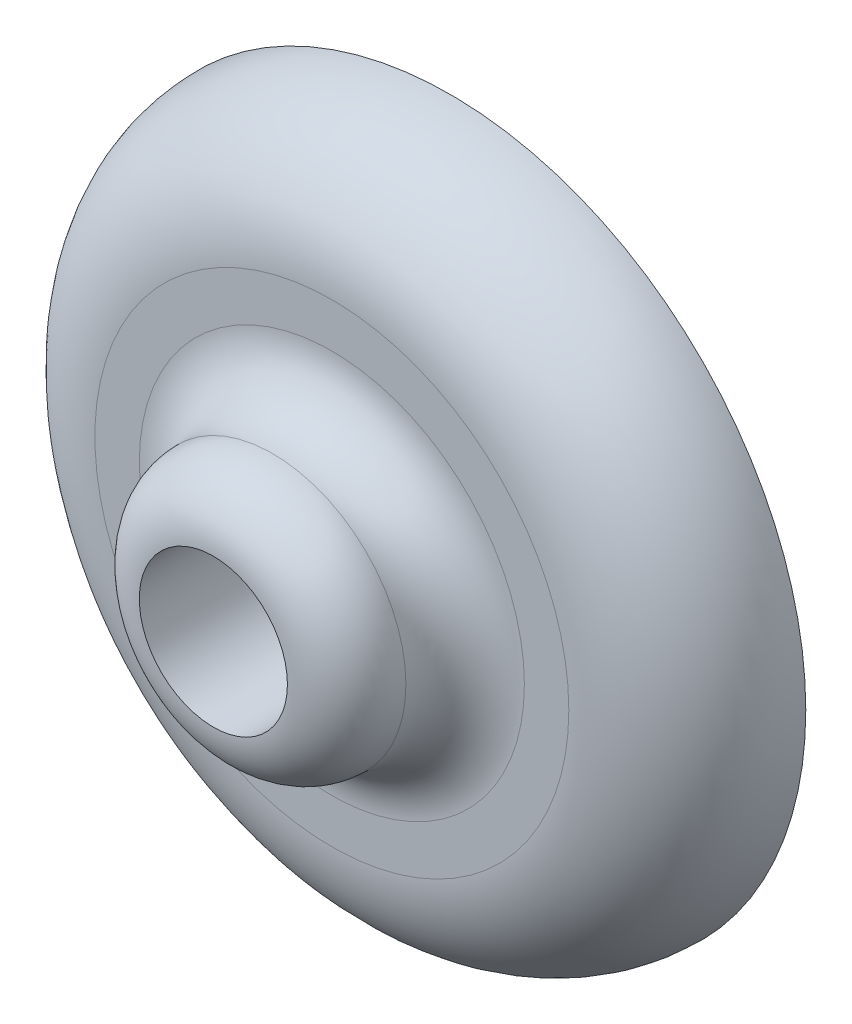
ISO-10303-21;
HEADER;
FILE_DESCRIPTION(('STEP AP214'),'2;1');
FILE_NAME('part.step','',(''),(''),'','','');
FILE_SCHEMA(('AUTOMOTIVE_DESIGN { 1 0 10303 214 1 1 1 1 }'));
ENDSEC;
DATA;
#1=APPLICATION_CONTEXT('core data for automotive mechanical design processes');
#2=APPLICATION_PROTOCOL_DEFINITION('international standard','automotive_design',2000,#1);
#3=PRODUCT_CONTEXT('',#1,'mechanical');
#4=PRODUCT('Part','Part','',(#3));
#5=PRODUCT_RELATED_PRODUCT_CATEGORY('part','',(#4));
#6=PRODUCT_DEFINITION_FORMATION('','',#4);
#7=PRODUCT_DEFINITION_CONTEXT('part definition',#1,'design');
#8=PRODUCT_DEFINITION('design','',#6,#7);
#9=PRODUCT_DEFINITION_SHAPE('','',#8);
#10=(LENGTH_UNIT() NAMED_UNIT(*) SI_UNIT(.MILLI.,.METRE.));
#11=(NAMED_UNIT(*) PLANE_ANGLE_UNIT() SI_UNIT($,.RADIAN.));
#12=(NAMED_UNIT(*) SI_UNIT($,.STERADIAN.) SOLID_ANGLE_UNIT());
#13=UNCERTAINTY_MEASURE_WITH_UNIT(LENGTH_MEASURE(1.E-05),#10,'distance_accuracy_value','');
#14=(GEOMETRIC_REPRESENTATION_CONTEXT(3) GLOBAL_UNCERTAINTY_ASSIGNED_CONTEXT((#13)) GLOBAL_UNIT_ASSIGNED_CONTEXT((#10,
#11,#12)) REPRESENTATION_CONTEXT('',''));
#15=CARTESIAN_POINT('',(0.,0.,0.));
#16=DIRECTION('',(0.,0.,1.));
#17=DIRECTION('',(1.,0.,0.));
#18=AXIS2_PLACEMENT_3D('',#15,#16,#17);
#19=CARTESIAN_POINT('',(0.,0.,2.));
#20=DIRECTION('',(0.,0.,1.));
#21=DIRECTION('',(1.,0.,0.));
#22=AXIS2_PLACEMENT_3D('',#19,#20,#21);
#23=PLANE('',#22);
#24=CARTESIAN_POINT('',(0.,0.,2.));
#25=DIRECTION('',(0.,0.,1.));
#26=DIRECTION('',(1.,0.,0.));
#27=AXIS2_PLACEMENT_3D('',#24,#25,#26);
#28=CIRCLE('',#27,4.);
#29=CARTESIAN_POINT('',(4.,0.,2.));
#30=VERTEX_POINT('',#29);
#31=EDGE_CURVE('E10',#30,#30,#28,.T.);
#32=ORIENTED_EDGE('',*,*,#31,.T.);
#33=EDGE_LOOP('',(#32));
#34=FACE_BOUND('',#33,.T.);
#35=CARTESIAN_POINT('',(0.,0.,2.));
#36=DIRECTION('',(0.,0.,1.));
#37=DIRECTION('',(1.,0.,0.));
#38=AXIS2_PLACEMENT_3D('',#35,#36,#37);
#39=CIRCLE('',#38,3.25);
#40=CARTESIAN_POINT('',(3.25,0.,2.));
#41=VERTEX_POINT('',#40);
#42=EDGE_CURVE('E39',#41,#41,#39,.F.);
#43=ORIENTED_EDGE('',*,*,#42,.T.);
#44=EDGE_LOOP('',(#43));
#45=FACE_BOUND('',#44,.T.);
#46=ADVANCED_FACE('F32',(#34,#45),#23,.T.);
#47=CARTESIAN_POINT('',(0.,0.,0.));
#48=DIRECTION('',(0.,0.,1.));
#49=DIRECTION('',(1.,0.,0.));
#50=AXIS2_PLACEMENT_3D('',#47,#48,#49);
#51=PLANE('',#50);
#52=CARTESIAN_POINT('',(0.,0.,0.));
#53=DIRECTION('',(0.,0.,1.));
#54=DIRECTION('',(1.,0.,0.));
#55=AXIS2_PLACEMENT_3D('',#52,#53,#54);
#56=CIRCLE('',#55,6.);
#57=CARTESIAN_POINT('',(6.,0.,0.));
#58=VERTEX_POINT('',#57);
#59=EDGE_CURVE('E43',#58,#58,#56,.T.);
#60=ORIENTED_EDGE('',*,*,#59,.F.);
#61=EDGE_LOOP('',(#60));
#62=FACE_BOUND('',#61,.T.);
#63=CARTESIAN_POINT('',(0.,0.,0.));
#64=DIRECTION('',(0.,0.,1.));
#65=DIRECTION('',(1.,0.,0.));
#66=AXIS2_PLACEMENT_3D('',#63,#64,#65);
#67=CIRCLE('',#66,1.25);
#68=CARTESIAN_POINT('',(1.25,0.,0.));
#69=VERTEX_POINT('',#68);
#70=EDGE_CURVE('E48',#69,#69,#67,.T.);
#71=ORIENTED_EDGE('',*,*,#70,.T.);
#72=EDGE_LOOP('',(#71));
#73=FACE_BOUND('',#72,.T.);
#74=ADVANCED_FACE('F63',(#62,#73),#51,.F.);
#75=CARTESIAN_POINT('',(0.,0.,2.));
#76=DIRECTION('',(0.,0.,-1.));
#77=DIRECTION('',(-1.,0.,0.));
#78=AXIS2_PLACEMENT_3D('',#75,#76,#77);
#79=CYLINDRICAL_SURFACE('',#78,1.25);
#80=ORIENTED_EDGE('',*,*,#70,.F.);
#81=EDGE_LOOP('',(#80));
#82=FACE_BOUND('',#81,.T.);
#83=CARTESIAN_POINT('',(0.,0.,4.));
#84=DIRECTION('',(0.,0.,1.));
#85=DIRECTION('',(1.,0.,0.));
#86=AXIS2_PLACEMENT_3D('',#83,#84,#85);
#87=CIRCLE('',#86,1.25);
#88=CARTESIAN_POINT('',(1.25,0.,4.));
#89=VERTEX_POINT('',#88);
#90=EDGE_CURVE('E53',#89,#89,#87,.T.);
#91=ORIENTED_EDGE('',*,*,#90,.T.);
#92=EDGE_LOOP('',(#91));
#93=FACE_BOUND('',#92,.T.);
#94=ADVANCED_FACE('F65',(#82,#93),#79,.F.);
#95=CARTESIAN_POINT('',(0.,0.,3.));
#96=DIRECTION('',(0.,0.,1.));
#97=DIRECTION('',(1.,0.,0.));
#98=AXIS2_PLACEMENT_3D('',#95,#96,#97);
#99=TOROIDAL_SURFACE('',#98,1.25,1.);
#100=ORIENTED_EDGE('',*,*,#90,.F.);
#101=EDGE_LOOP('',(#100));
#102=FACE_BOUND('',#101,.T.);
#103=CARTESIAN_POINT('',(0.,0.,3.));
#104=DIRECTION('',(0.,0.,1.));
#105=DIRECTION('',(1.,0.,0.));
#106=AXIS2_PLACEMENT_3D('',#103,#104,#105);
#107=CIRCLE('',#106,2.25);
#108=CARTESIAN_POINT('',(2.25,0.,3.));
#109=VERTEX_POINT('',#108);
#110=EDGE_CURVE('E51',#109,#109,#107,.F.);
#111=ORIENTED_EDGE('',*,*,#110,.F.);
#112=EDGE_LOOP('',(#111));
#113=FACE_BOUND('',#112,.T.);
#114=ADVANCED_FACE('F67',(#102,#113),#99,.T.);
#115=CARTESIAN_POINT('',(0.,0.,3.));
#116=DIRECTION('',(0.,0.,1.));
#117=DIRECTION('',(1.,0.,0.));
#118=AXIS2_PLACEMENT_3D('',#115,#116,#117);
#119=TOROIDAL_SURFACE('',#118,3.25,1.);
#120=ORIENTED_EDGE('',*,*,#42,.F.);
#121=EDGE_LOOP('',(#120));
#122=FACE_BOUND('',#121,.T.);
#123=ORIENTED_EDGE('',*,*,#110,.T.);
#124=EDGE_LOOP('',(#123));
#125=FACE_BOUND('',#124,.T.);
#126=ADVANCED_FACE('F73',(#122,#125),#119,.F.);
#127=CARTESIAN_POINT('',(0.,0.,0.));
#128=DIRECTION('',(0.,0.,1.));
#129=DIRECTION('',(1.,0.,0.));
#130=AXIS2_PLACEMENT_3D('',#127,#128,#129);
#131=TOROIDAL_SURFACE('',#130,4.,2.);
#132=ORIENTED_EDGE('',*,*,#59,.T.);
#133=EDGE_LOOP('',(#132));
#134=FACE_BOUND('',#133,.T.);
#135=ORIENTED_EDGE('',*,*,#31,.F.);
#136=EDGE_LOOP('',(#135));
#137=FACE_BOUND('',#136,.T.);
#138=ADVANCED_FACE('F34',(#134,#137),#131,.T.);
#139=CLOSED_SHELL('',(#46,#74,#94,#114,#126,#138));
#140=MANIFOLD_SOLID_BREP('B2',#139);
#141=ADVANCED_BREP_SHAPE_REPRESENTATION('',(#18,#140),#14);
#142=SHAPE_DEFINITION_REPRESENTATION(#9,#141);
ENDSEC;
END-ISO-10303-21;
